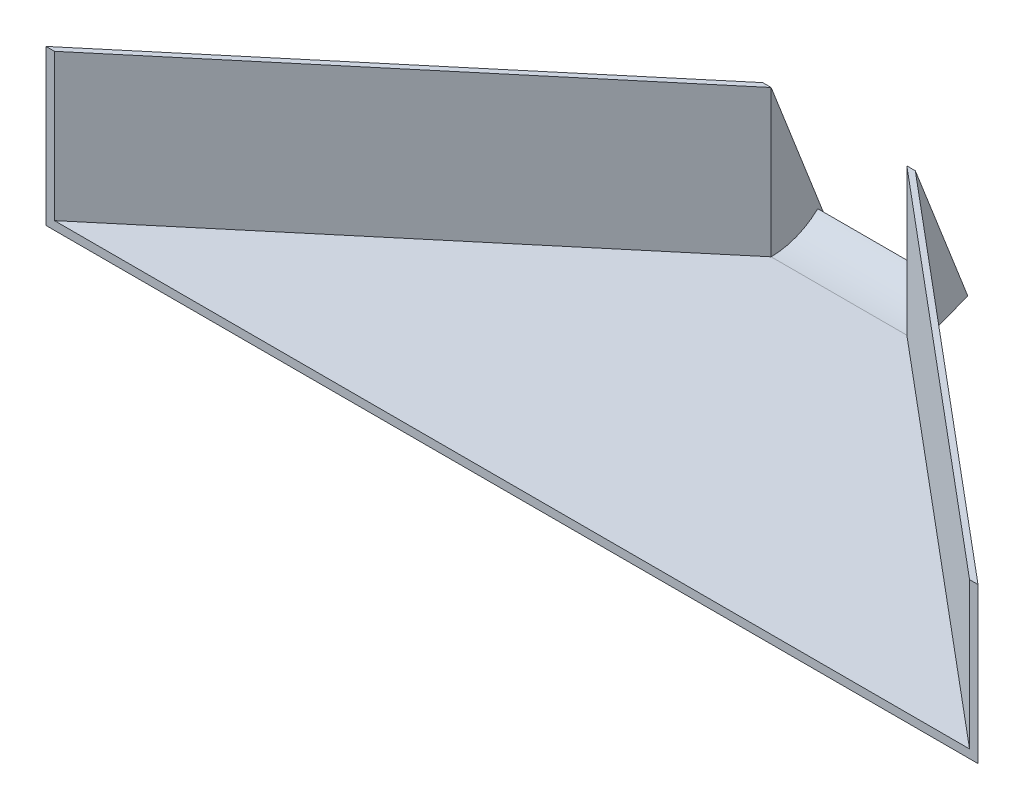
ISO-10303-21;
HEADER;
FILE_DESCRIPTION(('STEP AP214'),'2;1');
FILE_NAME('part.step','',(''),(''),'','','');
FILE_SCHEMA(('AUTOMOTIVE_DESIGN { 1 0 10303 214 1 1 1 1 }'));
ENDSEC;
DATA;
#1=APPLICATION_CONTEXT('core data for automotive mechanical design processes');
#2=APPLICATION_PROTOCOL_DEFINITION('international standard','automotive_design',2000,#1);
#3=PRODUCT_CONTEXT('',#1,'mechanical');
#4=PRODUCT('Part','Part','',(#3));
#5=PRODUCT_RELATED_PRODUCT_CATEGORY('part','',(#4));
#6=PRODUCT_DEFINITION_FORMATION('','',#4);
#7=PRODUCT_DEFINITION_CONTEXT('part definition',#1,'design');
#8=PRODUCT_DEFINITION('design','',#6,#7);
#9=PRODUCT_DEFINITION_SHAPE('','',#8);
#10=(LENGTH_UNIT() NAMED_UNIT(*) SI_UNIT(.MILLI.,.METRE.));
#11=(NAMED_UNIT(*) PLANE_ANGLE_UNIT() SI_UNIT($,.RADIAN.));
#12=(NAMED_UNIT(*) SI_UNIT($,.STERADIAN.) SOLID_ANGLE_UNIT());
#13=UNCERTAINTY_MEASURE_WITH_UNIT(LENGTH_MEASURE(1.E-05),#10,'distance_accuracy_value','');
#14=(GEOMETRIC_REPRESENTATION_CONTEXT(3) GLOBAL_UNCERTAINTY_ASSIGNED_CONTEXT((#13)) GLOBAL_UNIT_ASSIGNED_CONTEXT((#10,
#11,#12)) REPRESENTATION_CONTEXT('',''));
#15=CARTESIAN_POINT('',(0.,0.,0.));
#16=DIRECTION('',(0.,0.,1.));
#17=DIRECTION('',(1.,0.,0.));
#18=AXIS2_PLACEMENT_3D('',#15,#16,#17);
#19=CARTESIAN_POINT('',(0.,50.8,0.));
#20=DIRECTION('',(0.,1.,0.));
#21=DIRECTION('',(0.,0.,1.));
#22=AXIS2_PLACEMENT_3D('',#19,#20,#21);
#23=PLANE('',#22);
#24=DIRECTION('',(0.766044443118982,0.,-0.642787609686535));
#25=VECTOR('',#24,1.);
#26=CARTESIAN_POINT('',(0.,50.8,0.));
#27=LINE('',#26,#25);
#28=CARTESIAN_POINT('',(-127.635000000001,50.8,107.098481425312));
#29=VERTEX_POINT('',#28);
#30=CARTESIAN_POINT('',(1.38777878078145E-13,50.8,0.));
#31=VERTEX_POINT('',#30);
#32=EDGE_CURVE('E98',#29,#31,#27,.T.);
#33=ORIENTED_EDGE('',*,*,#32,.T.);
#34=DIRECTION('',(-1.,0.,0.));
#35=VECTOR('',#34,1.);
#36=CARTESIAN_POINT('',(101.246126628495,50.8,0.));
#37=LINE('',#36,#35);
#38=CARTESIAN_POINT('',(-2.76859999999986,50.8,0.));
#39=VERTEX_POINT('',#38);
#40=EDGE_CURVE('E183',#31,#39,#37,.T.);
#41=ORIENTED_EDGE('',*,*,#40,.T.);
#42=DIRECTION('',(-0.766044443118982,0.,0.642787609686535));
#43=VECTOR('',#42,1.);
#44=CARTESIAN_POINT('',(-1.14391882765566,50.8,-1.3632693724948));
#45=LINE('',#44,#43);
#46=CARTESIAN_POINT('',(-130.403600000001,50.8,107.098481425312));
#47=VERTEX_POINT('',#46);
#48=EDGE_CURVE('E100',#39,#47,#45,.T.);
#49=ORIENTED_EDGE('',*,*,#48,.T.);
#50=DIRECTION('',(1.,0.,0.));
#51=VECTOR('',#50,1.);
#52=CARTESIAN_POINT('',(0.,50.8,107.098481425312));
#53=LINE('',#52,#51);
#54=EDGE_CURVE('E62',#47,#29,#53,.T.);
#55=ORIENTED_EDGE('',*,*,#54,.T.);
#56=EDGE_LOOP('',(#33,#41,#49,#55));
#57=FACE_BOUND('',#56,.T.);
#58=ADVANCED_FACE('F38',(#57),#23,.T.);
#59=CARTESIAN_POINT('',(0.,0.,0.));
#60=DIRECTION('',(0.,1.,0.));
#61=DIRECTION('',(0.,0.,1.));
#62=AXIS2_PLACEMENT_3D('',#59,#60,#61);
#63=PLANE('',#62);
#64=DIRECTION('',(-0.766044443118982,0.,0.642787609686535));
#65=VECTOR('',#64,1.);
#66=CARTESIAN_POINT('',(-1.14391882765566,0.,-1.3632693724948));
#67=LINE('',#66,#65);
#68=CARTESIAN_POINT('',(-2.7686,0.,0.));
#69=VERTEX_POINT('',#68);
#70=CARTESIAN_POINT('',(-130.403600000001,0.,107.098481425312));
#71=VERTEX_POINT('',#70);
#72=EDGE_CURVE('E75',#69,#71,#67,.T.);
#73=ORIENTED_EDGE('',*,*,#72,.F.);
#74=DIRECTION('',(-1.,0.,0.));
#75=VECTOR('',#74,1.);
#76=CARTESIAN_POINT('',(0.,0.,0.));
#77=LINE('',#76,#75);
#78=CARTESIAN_POINT('',(47.2186,0.,0.));
#79=VERTEX_POINT('',#78);
#80=EDGE_CURVE('E85',#79,#69,#77,.T.);
#81=ORIENTED_EDGE('',*,*,#80,.F.);
#82=DIRECTION('',(-0.766044443118977,0.,-0.642787609686541));
#83=VECTOR('',#82,1.);
#84=CARTESIAN_POINT('',(19.5095880790082,0.,-23.2506216831911));
#85=LINE('',#84,#83);
#86=CARTESIAN_POINT('',(174.853599999999,0.,107.098481425312));
#87=VERTEX_POINT('',#86);
#88=EDGE_CURVE('E97',#87,#79,#85,.T.);
#89=ORIENTED_EDGE('',*,*,#88,.F.);
#90=DIRECTION('',(1.,0.,0.));
#91=VECTOR('',#90,1.);
#92=CARTESIAN_POINT('',(0.,0.,107.098481425312));
#93=LINE('',#92,#91);
#94=EDGE_CURVE('E84',#71,#87,#93,.T.);
#95=ORIENTED_EDGE('',*,*,#94,.F.);
#96=EDGE_LOOP('',(#73,#81,#89,#95));
#97=FACE_BOUND('',#96,.T.);
#98=ADVANCED_FACE('F95',(#97),#63,.F.);
#99=CARTESIAN_POINT('',(1.4312316017158E-13,50.8,-25.4));
#100=DIRECTION('',(1.,0.,0.));
#101=DIRECTION('',(0.,0.,-1.));
#102=AXIS2_PLACEMENT_3D('',#99,#100,#101);
#103=PLANE('',#102);
#104=DIRECTION('',(0.,-0.736335815451118,-0.676616262651096));
#105=VECTOR('',#104,1.);
#106=CARTESIAN_POINT('',(1.11022302462516E-13,6.6970893940882,-17.1860355144027));
#107=LINE('',#106,#105);
#108=CARTESIAN_POINT('',(1.11022302462516E-13,8.75161916953628,-15.2981356879934));
#109=VERTEX_POINT('',#108);
#110=CARTESIAN_POINT('',(1.38777878078145E-13,6.6970893940882,-17.1860355144027));
#111=VERTEX_POINT('',#110);
#112=EDGE_CURVE('E171',#109,#111,#107,.T.);
#113=ORIENTED_EDGE('',*,*,#112,.T.);
#114=DIRECTION('',(0.,0.931755355446204,0.363086708097829));
#115=VECTOR('',#114,1.);
#116=CARTESIAN_POINT('',(1.38306714687285E-13,42.2069771870583,-3.34853172297188));
#117=LINE('',#116,#115);
#118=EDGE_CURVE('E166',#111,#31,#117,.T.);
#119=ORIENTED_EDGE('',*,*,#118,.T.);
#120=DIRECTION('',(0.,-1.,0.));
#121=VECTOR('',#120,1.);
#122=CARTESIAN_POINT('',(0.,50.8,0.));
#123=LINE('',#122,#121);
#124=CARTESIAN_POINT('',(1.04083408558608E-13,2.7686,0.));
#125=VERTEX_POINT('',#124);
#126=EDGE_CURVE('E11',#31,#125,#123,.T.);
#127=ORIENTED_EDGE('',*,*,#126,.T.);
#128=CARTESIAN_POINT('',(1.07552855510562E-13,25.3182080043655,0.));
#129=DIRECTION('',(-1.,0.,0.));
#130=DIRECTION('',(0.,0.,1.));
#131=AXIS2_PLACEMENT_3D('',#128,#129,#130);
#132=CIRCLE('',#131,22.5496080043655);
#133=EDGE_CURVE('E159',#125,#109,#132,.F.);
#134=ORIENTED_EDGE('',*,*,#133,.T.);
#135=EDGE_LOOP('',(#113,#119,#127,#134));
#136=FACE_BOUND('',#135,.T.);
#137=ADVANCED_FACE('F258',(#136),#103,.T.);
#138=CARTESIAN_POINT('',(-2.76859999999987,0.,-25.4));
#139=DIRECTION('',(-1.,0.,0.));
#140=DIRECTION('',(0.,0.,1.));
#141=AXIS2_PLACEMENT_3D('',#138,#139,#140);
#142=PLANE('',#141);
#143=DIRECTION('',(0.,-1.,0.));
#144=VECTOR('',#143,1.);
#145=CARTESIAN_POINT('',(-2.7686,50.8,0.));
#146=LINE('',#145,#144);
#147=EDGE_CURVE('E46',#39,#69,#146,.T.);
#148=ORIENTED_EDGE('',*,*,#147,.F.);
#149=DIRECTION('',(0.,-0.931755355446204,-0.363086708097829));
#150=VECTOR('',#149,1.);
#151=CARTESIAN_POINT('',(-2.76859999999986,50.8,0.));
#152=LINE('',#151,#150);
#153=CARTESIAN_POINT('',(-2.76859999999987,6.6970893940882,-17.1860355144027));
#154=VERTEX_POINT('',#153);
#155=EDGE_CURVE('E186',#39,#154,#152,.T.);
#156=ORIENTED_EDGE('',*,*,#155,.T.);
#157=DIRECTION('',(0.,-0.36308811489704,0.931754807243039));
#158=VECTOR('',#157,1.);
#159=CARTESIAN_POINT('',(-2.76859999999987,6.6970893940882,-17.1860355144027));
#160=LINE('',#159,#158);
#161=EDGE_CURVE('E182',#154,#69,#160,.T.);
#162=ORIENTED_EDGE('',*,*,#161,.T.);
#163=EDGE_LOOP('',(#148,#156,#162));
#164=FACE_BOUND('',#163,.T.);
#165=ADVANCED_FACE('F193',(#164),#142,.T.);
#166=CARTESIAN_POINT('',(44.45,50.8,-25.4));
#167=DIRECTION('',(1.,0.,0.));
#168=DIRECTION('',(0.,0.,-1.));
#169=AXIS2_PLACEMENT_3D('',#166,#167,#168);
#170=PLANE('',#169);
#171=CARTESIAN_POINT('',(44.45,25.3182080043655,0.));
#172=DIRECTION('',(1.,0.,0.));
#173=DIRECTION('',(0.,0.,-1.));
#174=AXIS2_PLACEMENT_3D('',#171,#172,#173);
#175=CIRCLE('',#174,22.5496080043655);
#176=CARTESIAN_POINT('',(44.45,2.7686,0.));
#177=VERTEX_POINT('',#176);
#178=CARTESIAN_POINT('',(44.45,8.75161916953628,-15.2981356879934));
#179=VERTEX_POINT('',#178);
#180=EDGE_CURVE('E165',#177,#179,#175,.T.);
#181=ORIENTED_EDGE('',*,*,#180,.F.);
#182=DIRECTION('',(0.,-1.,0.));
#183=VECTOR('',#182,1.);
#184=CARTESIAN_POINT('',(44.45,50.8,0.));
#185=LINE('',#184,#183);
#186=CARTESIAN_POINT('',(44.45,50.8,0.));
#187=VERTEX_POINT('',#186);
#188=EDGE_CURVE('E134',#187,#177,#185,.T.);
#189=ORIENTED_EDGE('',*,*,#188,.F.);
#190=DIRECTION('',(0.,0.931755355446204,0.363086708097829));
#191=VECTOR('',#190,1.);
#192=CARTESIAN_POINT('',(44.45,50.8,0.));
#193=LINE('',#192,#191);
#194=CARTESIAN_POINT('',(44.45,6.6970893940882,-17.1860355144027));
#195=VERTEX_POINT('',#194);
#196=EDGE_CURVE('E140',#195,#187,#193,.T.);
#197=ORIENTED_EDGE('',*,*,#196,.F.);
#198=DIRECTION('',(0.,-0.736335815451118,-0.676616262651096));
#199=VECTOR('',#198,1.);
#200=CARTESIAN_POINT('',(44.45,6.6970893940882,-17.1860355144027));
#201=LINE('',#200,#199);
#202=EDGE_CURVE('E170',#179,#195,#201,.T.);
#203=ORIENTED_EDGE('',*,*,#202,.F.);
#204=EDGE_LOOP('',(#181,#189,#197,#203));
#205=FACE_BOUND('',#204,.T.);
#206=ADVANCED_FACE('F251',(#205),#170,.F.);
#207=CARTESIAN_POINT('',(0.,50.8,0.));
#208=DIRECTION('',(-0.642787609686535,0.,-0.766044443118982));
#209=DIRECTION('',(-0.766044443118982,0.,0.642787609686535));
#210=AXIS2_PLACEMENT_3D('',#207,#208,#209);
#211=PLANE('',#210);
#212=DIRECTION('',(0.,-1.,0.));
#213=VECTOR('',#212,1.);
#214=CARTESIAN_POINT('',(-127.635000000001,50.8,107.098481425312));
#215=LINE('',#214,#213);
#216=CARTESIAN_POINT('',(-127.635000000001,2.7686,107.098481425312));
#217=VERTEX_POINT('',#216);
#218=EDGE_CURVE('E53',#29,#217,#215,.T.);
#219=ORIENTED_EDGE('',*,*,#218,.T.);
#220=DIRECTION('',(-0.766044443118982,0.,0.642787609686535));
#221=VECTOR('',#220,1.);
#222=CARTESIAN_POINT('',(0.,2.7686,0.));
#223=LINE('',#222,#221);
#224=EDGE_CURVE('E124',#125,#217,#223,.T.);
#225=ORIENTED_EDGE('',*,*,#224,.F.);
#226=ORIENTED_EDGE('',*,*,#126,.F.);
#227=ORIENTED_EDGE('',*,*,#32,.F.);
#228=EDGE_LOOP('',(#219,#225,#226,#227));
#229=FACE_BOUND('',#228,.T.);
#230=ADVANCED_FACE('F40',(#229),#211,.F.);
#231=CARTESIAN_POINT('',(-1.14391882765566,50.8,-1.3632693724948));
#232=DIRECTION('',(0.642787609686535,0.,0.766044443118982));
#233=DIRECTION('',(0.766044443118982,0.,-0.642787609686535));
#234=AXIS2_PLACEMENT_3D('',#231,#232,#233);
#235=PLANE('',#234);
#236=ORIENTED_EDGE('',*,*,#72,.T.);
#237=DIRECTION('',(0.,-1.,0.));
#238=VECTOR('',#237,1.);
#239=CARTESIAN_POINT('',(-130.403600000001,50.8,107.098481425312));
#240=LINE('',#239,#238);
#241=EDGE_CURVE('E79',#47,#71,#240,.T.);
#242=ORIENTED_EDGE('',*,*,#241,.F.);
#243=ORIENTED_EDGE('',*,*,#48,.F.);
#244=ORIENTED_EDGE('',*,*,#147,.T.);
#245=EDGE_LOOP('',(#236,#242,#243,#244));
#246=FACE_BOUND('',#245,.T.);
#247=ADVANCED_FACE('F77',(#246),#235,.F.);
#248=CARTESIAN_POINT('',(0.,50.8,107.098481425312));
#249=DIRECTION('',(0.,0.,-1.));
#250=DIRECTION('',(-1.,0.,0.));
#251=AXIS2_PLACEMENT_3D('',#248,#249,#250);
#252=PLANE('',#251);
#253=ORIENTED_EDGE('',*,*,#94,.T.);
#254=DIRECTION('',(0.,-1.,0.));
#255=VECTOR('',#254,1.);
#256=CARTESIAN_POINT('',(174.853599999999,50.8,107.098481425312));
#257=LINE('',#256,#255);
#258=CARTESIAN_POINT('',(174.853599999999,50.8,107.098481425312));
#259=VERTEX_POINT('',#258);
#260=EDGE_CURVE('E129',#259,#87,#257,.T.);
#261=ORIENTED_EDGE('',*,*,#260,.F.);
#262=DIRECTION('',(1.,0.,0.));
#263=VECTOR('',#262,1.);
#264=CARTESIAN_POINT('',(-5.36838113038942E-13,50.8,107.098481425311));
#265=LINE('',#264,#263);
#266=CARTESIAN_POINT('',(172.084999999999,50.8,107.098481425312));
#267=VERTEX_POINT('',#266);
#268=EDGE_CURVE('E143',#267,#259,#265,.T.);
#269=ORIENTED_EDGE('',*,*,#268,.F.);
#270=DIRECTION('',(0.,-1.,0.));
#271=VECTOR('',#270,1.);
#272=CARTESIAN_POINT('',(172.084999999999,50.8,107.098481425312));
#273=LINE('',#272,#271);
#274=CARTESIAN_POINT('',(172.084999999999,2.7686,107.098481425312));
#275=VERTEX_POINT('',#274);
#276=EDGE_CURVE('E126',#267,#275,#273,.T.);
#277=ORIENTED_EDGE('',*,*,#276,.T.);
#278=DIRECTION('',(1.,0.,0.));
#279=VECTOR('',#278,1.);
#280=CARTESIAN_POINT('',(-127.635000000001,2.7686,107.098481425312));
#281=LINE('',#280,#279);
#282=EDGE_CURVE('E119',#217,#275,#281,.T.);
#283=ORIENTED_EDGE('',*,*,#282,.F.);
#284=ORIENTED_EDGE('',*,*,#218,.F.);
#285=ORIENTED_EDGE('',*,*,#54,.F.);
#286=ORIENTED_EDGE('',*,*,#241,.T.);
#287=EDGE_LOOP('',(#253,#261,#269,#277,#283,#284,#285,#286));
#288=FACE_BOUND('',#287,.T.);
#289=ADVANCED_FACE('F89',(#288),#252,.F.);
#290=CARTESIAN_POINT('',(0.,2.7686,0.));
#291=DIRECTION('',(0.,1.,0.));
#292=DIRECTION('',(0.,0.,1.));
#293=AXIS2_PLACEMENT_3D('',#290,#291,#292);
#294=PLANE('',#293);
#295=ORIENTED_EDGE('',*,*,#224,.T.);
#296=ORIENTED_EDGE('',*,*,#282,.T.);
#297=DIRECTION('',(-0.766044443118977,0.,-0.64278760968654));
#298=VECTOR('',#297,1.);
#299=CARTESIAN_POINT('',(44.45,2.7686,0.));
#300=LINE('',#299,#298);
#301=EDGE_CURVE('E112',#275,#177,#300,.T.);
#302=ORIENTED_EDGE('',*,*,#301,.T.);
#303=DIRECTION('',(-1.,0.,0.));
#304=VECTOR('',#303,1.);
#305=CARTESIAN_POINT('',(0.,2.7686,0.));
#306=LINE('',#305,#304);
#307=EDGE_CURVE('E106',#177,#125,#306,.T.);
#308=ORIENTED_EDGE('',*,*,#307,.T.);
#309=EDGE_LOOP('',(#295,#296,#302,#308));
#310=FACE_BOUND('',#309,.T.);
#311=ADVANCED_FACE('F235',(#310),#294,.T.);
#312=CARTESIAN_POINT('',(18.3656692513525,50.8,-21.8873523106963));
#313=DIRECTION('',(0.64278760968654,0.,-0.766044443118977));
#314=DIRECTION('',(-0.766044443118977,0.,-0.642787609686541));
#315=AXIS2_PLACEMENT_3D('',#312,#313,#314);
#316=PLANE('',#315);
#317=ORIENTED_EDGE('',*,*,#301,.F.);
#318=ORIENTED_EDGE('',*,*,#276,.F.);
#319=DIRECTION('',(0.766044443118977,0.,0.642787609686541));
#320=VECTOR('',#319,1.);
#321=CARTESIAN_POINT('',(18.3656692513525,50.8,-21.8873523106963));
#322=LINE('',#321,#320);
#323=EDGE_CURVE('E139',#187,#267,#322,.T.);
#324=ORIENTED_EDGE('',*,*,#323,.F.);
#325=ORIENTED_EDGE('',*,*,#188,.T.);
#326=EDGE_LOOP('',(#317,#318,#324,#325));
#327=FACE_BOUND('',#326,.T.);
#328=ADVANCED_FACE('F238',(#327),#316,.F.);
#329=CARTESIAN_POINT('',(19.5095880790082,50.8,-23.2506216831911));
#330=DIRECTION('',(-0.64278760968654,0.,0.766044443118977));
#331=DIRECTION('',(0.766044443118977,0.,0.642787609686541));
#332=AXIS2_PLACEMENT_3D('',#329,#330,#331);
#333=PLANE('',#332);
#334=ORIENTED_EDGE('',*,*,#88,.T.);
#335=DIRECTION('',(0.,-1.,0.));
#336=VECTOR('',#335,1.);
#337=CARTESIAN_POINT('',(47.2186,50.8,0.));
#338=LINE('',#337,#336);
#339=CARTESIAN_POINT('',(47.2186,50.8,0.));
#340=VERTEX_POINT('',#339);
#341=EDGE_CURVE('E131',#340,#79,#338,.T.);
#342=ORIENTED_EDGE('',*,*,#341,.F.);
#343=DIRECTION('',(-0.766044443118977,0.,-0.642787609686541));
#344=VECTOR('',#343,1.);
#345=CARTESIAN_POINT('',(19.5095880790082,50.8,-23.2506216831911));
#346=LINE('',#345,#344);
#347=EDGE_CURVE('E137',#259,#340,#346,.T.);
#348=ORIENTED_EDGE('',*,*,#347,.F.);
#349=ORIENTED_EDGE('',*,*,#260,.T.);
#350=EDGE_LOOP('',(#334,#342,#348,#349));
#351=FACE_BOUND('',#350,.T.);
#352=ADVANCED_FACE('F301',(#351),#333,.F.);
#353=CARTESIAN_POINT('',(0.,50.8,0.));
#354=DIRECTION('',(0.,1.,0.));
#355=DIRECTION('',(0.,0.,1.));
#356=AXIS2_PLACEMENT_3D('',#353,#354,#355);
#357=PLANE('',#356);
#358=DIRECTION('',(1.,0.,0.));
#359=VECTOR('',#358,1.);
#360=CARTESIAN_POINT('',(-12.3461266284947,50.8,0.));
#361=LINE('',#360,#359);
#362=EDGE_CURVE('E151',#187,#340,#361,.T.);
#363=ORIENTED_EDGE('',*,*,#362,.F.);
#364=ORIENTED_EDGE('',*,*,#323,.T.);
#365=ORIENTED_EDGE('',*,*,#268,.T.);
#366=ORIENTED_EDGE('',*,*,#347,.T.);
#367=EDGE_LOOP('',(#363,#364,#365,#366));
#368=FACE_BOUND('',#367,.T.);
#369=ADVANCED_FACE('F244',(#368),#357,.T.);
#370=CARTESIAN_POINT('',(47.2186,0.,-25.4));
#371=DIRECTION('',(-1.,0.,0.));
#372=DIRECTION('',(0.,0.,1.));
#373=AXIS2_PLACEMENT_3D('',#370,#371,#372);
#374=PLANE('',#373);
#375=DIRECTION('',(0.,-0.36308811489704,0.931754807243039));
#376=VECTOR('',#375,1.);
#377=CARTESIAN_POINT('',(47.2186,6.6970893940882,-17.1860355144027));
#378=LINE('',#377,#376);
#379=CARTESIAN_POINT('',(47.2186,6.6970893940882,-17.1860355144027));
#380=VERTEX_POINT('',#379);
#381=EDGE_CURVE('E152',#380,#79,#378,.T.);
#382=ORIENTED_EDGE('',*,*,#381,.F.);
#383=DIRECTION('',(0.,-0.931755355446204,-0.363086708097829));
#384=VECTOR('',#383,1.);
#385=CARTESIAN_POINT('',(47.2186,50.8,0.));
#386=LINE('',#385,#384);
#387=EDGE_CURVE('E156',#340,#380,#386,.T.);
#388=ORIENTED_EDGE('',*,*,#387,.F.);
#389=ORIENTED_EDGE('',*,*,#341,.T.);
#390=EDGE_LOOP('',(#382,#388,#389));
#391=FACE_BOUND('',#390,.T.);
#392=ADVANCED_FACE('F295',(#391),#374,.F.);
#393=CARTESIAN_POINT('',(-12.3461266284947,50.8,0.));
#394=DIRECTION('',(0.,-0.363086708097829,0.931755355446204));
#395=DIRECTION('',(0.,-0.931755355446204,-0.363086708097829));
#396=AXIS2_PLACEMENT_3D('',#393,#394,#395);
#397=PLANE('',#396);
#398=ORIENTED_EDGE('',*,*,#196,.T.);
#399=ORIENTED_EDGE('',*,*,#362,.T.);
#400=ORIENTED_EDGE('',*,*,#387,.T.);
#401=DIRECTION('',(1.,0.,0.));
#402=VECTOR('',#401,1.);
#403=CARTESIAN_POINT('',(-12.3461266284947,6.6970893940882,-17.1860355144027));
#404=LINE('',#403,#402);
#405=EDGE_CURVE('E148',#195,#380,#404,.T.);
#406=ORIENTED_EDGE('',*,*,#405,.F.);
#407=EDGE_LOOP('',(#398,#399,#400,#406));
#408=FACE_BOUND('',#407,.T.);
#409=ADVANCED_FACE('F293',(#408),#397,.F.);
#410=CARTESIAN_POINT('',(-12.3461266284947,6.6970893940882,-17.1860355144027));
#411=DIRECTION('',(0.,0.931754807243039,0.36308811489704));
#412=DIRECTION('',(0.,-0.36308811489704,0.93175480724304));
#413=AXIS2_PLACEMENT_3D('',#410,#411,#412);
#414=PLANE('',#413);
#415=ORIENTED_EDGE('',*,*,#80,.T.);
#416=ORIENTED_EDGE('',*,*,#161,.F.);
#417=DIRECTION('',(-1.,0.,0.));
#418=VECTOR('',#417,1.);
#419=CARTESIAN_POINT('',(101.246126628495,6.69708939408819,-17.1860355144026));
#420=LINE('',#419,#418);
#421=EDGE_CURVE('E187',#111,#154,#420,.T.);
#422=ORIENTED_EDGE('',*,*,#421,.F.);
#423=DIRECTION('',(1.,0.,0.));
#424=VECTOR('',#423,1.);
#425=CARTESIAN_POINT('',(-19.2860222646066,6.6970893940882,-17.1860355144027));
#426=LINE('',#425,#424);
#427=EDGE_CURVE('E162',#111,#195,#426,.T.);
#428=ORIENTED_EDGE('',*,*,#427,.T.);
#429=ORIENTED_EDGE('',*,*,#405,.T.);
#430=ORIENTED_EDGE('',*,*,#381,.T.);
#431=EDGE_LOOP('',(#415,#416,#422,#428,#429,#430));
#432=FACE_BOUND('',#431,.T.);
#433=ADVANCED_FACE('F198',(#432),#414,.F.);
#434=CARTESIAN_POINT('',(-19.2860222646066,25.3182080043655,0.));
#435=DIRECTION('',(1.,0.,0.));
#436=DIRECTION('',(0.,0.,-1.));
#437=AXIS2_PLACEMENT_3D('',#434,#435,#436);
#438=CYLINDRICAL_SURFACE('',#437,22.5496080043655);
#439=ORIENTED_EDGE('',*,*,#133,.F.);
#440=ORIENTED_EDGE('',*,*,#307,.F.);
#441=ORIENTED_EDGE('',*,*,#180,.T.);
#442=DIRECTION('',(1.,0.,0.));
#443=VECTOR('',#442,1.);
#444=CARTESIAN_POINT('',(-19.2860222646066,8.75161916953628,-15.2981356879934));
#445=LINE('',#444,#443);
#446=EDGE_CURVE('E167',#109,#179,#445,.T.);
#447=ORIENTED_EDGE('',*,*,#446,.F.);
#448=EDGE_LOOP('',(#439,#440,#441,#447));
#449=FACE_BOUND('',#448,.T.);
#450=ADVANCED_FACE('F254',(#449),#438,.F.);
#451=CARTESIAN_POINT('',(-19.2860222646066,6.6970893940882,-17.1860355144027));
#452=DIRECTION('',(0.,-0.676616262651096,0.736335815451118));
#453=DIRECTION('',(0.,-0.736335815451118,-0.676616262651096));
#454=AXIS2_PLACEMENT_3D('',#451,#452,#453);
#455=PLANE('',#454);
#456=ORIENTED_EDGE('',*,*,#112,.F.);
#457=ORIENTED_EDGE('',*,*,#446,.T.);
#458=ORIENTED_EDGE('',*,*,#202,.T.);
#459=ORIENTED_EDGE('',*,*,#427,.F.);
#460=EDGE_LOOP('',(#456,#457,#458,#459));
#461=FACE_BOUND('',#460,.T.);
#462=ADVANCED_FACE('F261',(#461),#455,.F.);
#463=CARTESIAN_POINT('',(101.246126628495,50.8,0.));
#464=DIRECTION('',(0.,0.363086708097829,-0.931755355446204));
#465=DIRECTION('',(0.,0.931755355446204,0.363086708097829));
#466=AXIS2_PLACEMENT_3D('',#463,#464,#465);
#467=PLANE('',#466);
#468=ORIENTED_EDGE('',*,*,#421,.T.);
#469=ORIENTED_EDGE('',*,*,#155,.F.);
#470=ORIENTED_EDGE('',*,*,#40,.F.);
#471=ORIENTED_EDGE('',*,*,#118,.F.);
#472=EDGE_LOOP('',(#468,#469,#470,#471));
#473=FACE_BOUND('',#472,.T.);
#474=ADVANCED_FACE('F259',(#473),#467,.T.);
#475=CLOSED_SHELL('',(#58,#98,#137,#165,#206,#230,#247,#289,#311,#328,#352,#369,#392,#409,#433,
#450,#462,#474));
#476=MANIFOLD_SOLID_BREP('B2',#475);
#477=ADVANCED_BREP_SHAPE_REPRESENTATION('',(#18,#476),#14);
#478=SHAPE_DEFINITION_REPRESENTATION(#9,#477);
ENDSEC;
END-ISO-10303-21;
